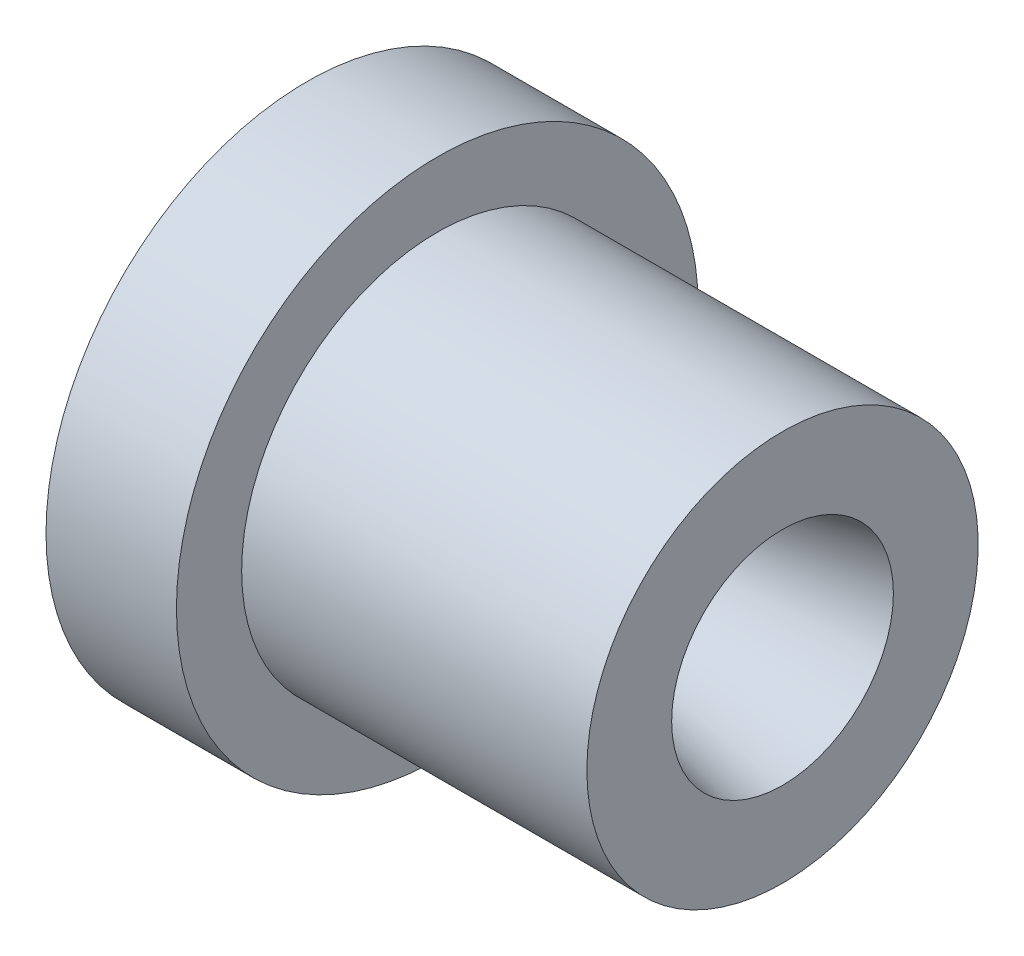
ISO-10303-21;
HEADER;
FILE_DESCRIPTION(('STEP AP214'),'2;1');
FILE_NAME('part.step','',(''),(''),'','','');
FILE_SCHEMA(('AUTOMOTIVE_DESIGN { 1 0 10303 214 1 1 1 1 }'));
ENDSEC;
DATA;
#1=APPLICATION_CONTEXT('core data for automotive mechanical design processes');
#2=APPLICATION_PROTOCOL_DEFINITION('international standard','automotive_design',2000,#1);
#3=PRODUCT_CONTEXT('',#1,'mechanical');
#4=PRODUCT('Part','Part','',(#3));
#5=PRODUCT_RELATED_PRODUCT_CATEGORY('part','',(#4));
#6=PRODUCT_DEFINITION_FORMATION('','',#4);
#7=PRODUCT_DEFINITION_CONTEXT('part definition',#1,'design');
#8=PRODUCT_DEFINITION('design','',#6,#7);
#9=PRODUCT_DEFINITION_SHAPE('','',#8);
#10=(LENGTH_UNIT() NAMED_UNIT(*) SI_UNIT(.MILLI.,.METRE.));
#11=(NAMED_UNIT(*) PLANE_ANGLE_UNIT() SI_UNIT($,.RADIAN.));
#12=(NAMED_UNIT(*) SI_UNIT($,.STERADIAN.) SOLID_ANGLE_UNIT());
#13=UNCERTAINTY_MEASURE_WITH_UNIT(LENGTH_MEASURE(1.E-05),#10,'distance_accuracy_value','');
#14=(GEOMETRIC_REPRESENTATION_CONTEXT(3) GLOBAL_UNCERTAINTY_ASSIGNED_CONTEXT((#13)) GLOBAL_UNIT_ASSIGNED_CONTEXT((#10,
#11,#12)) REPRESENTATION_CONTEXT('',''));
#15=CARTESIAN_POINT('',(0.,0.,0.));
#16=DIRECTION('',(0.,0.,1.));
#17=DIRECTION('',(1.,0.,0.));
#18=AXIS2_PLACEMENT_3D('',#15,#16,#17);
#19=CARTESIAN_POINT('',(-10.,20.,0.));
#20=DIRECTION('',(1.,0.,0.));
#21=DIRECTION('',(0.,0.,-1.));
#22=AXIS2_PLACEMENT_3D('',#19,#20,#21);
#23=PLANE('',#22);
#24=CARTESIAN_POINT('',(-10.,0.,0.));
#25=DIRECTION('',(-1.,0.,0.));
#26=DIRECTION('',(0.,0.,1.));
#27=AXIS2_PLACEMENT_3D('',#24,#25,#26);
#28=CIRCLE('',#27,15.);
#29=CARTESIAN_POINT('',(-10.,0.,15.));
#30=VERTEX_POINT('',#29);
#31=EDGE_CURVE('E10',#30,#30,#28,.T.);
#32=ORIENTED_EDGE('',*,*,#31,.F.);
#33=EDGE_LOOP('',(#32));
#34=FACE_BOUND('',#33,.T.);
#35=CARTESIAN_POINT('',(-10.,0.,0.));
#36=DIRECTION('',(-1.,0.,0.));
#37=DIRECTION('',(0.,0.,1.));
#38=AXIS2_PLACEMENT_3D('',#35,#36,#37);
#39=CIRCLE('',#38,20.);
#40=CARTESIAN_POINT('',(-10.,0.,20.));
#41=VERTEX_POINT('',#40);
#42=EDGE_CURVE('E61',#41,#41,#39,.T.);
#43=ORIENTED_EDGE('',*,*,#42,.T.);
#44=EDGE_LOOP('',(#43));
#45=FACE_BOUND('',#44,.T.);
#46=ADVANCED_FACE('F33',(#34,#45),#23,.F.);
#47=CARTESIAN_POINT('',(-10.,0.,0.));
#48=DIRECTION('',(-1.,0.,0.));
#49=DIRECTION('',(0.,0.,1.));
#50=AXIS2_PLACEMENT_3D('',#47,#48,#49);
#51=CONICAL_SURFACE('',#50,15.,0.78539816339745);
#52=CARTESIAN_POINT('',(0.,0.,0.));
#53=DIRECTION('',(-1.,0.,0.));
#54=DIRECTION('',(0.,0.,1.));
#55=AXIS2_PLACEMENT_3D('',#52,#53,#54);
#56=CIRCLE('',#55,5.);
#57=CARTESIAN_POINT('',(0.,0.,5.));
#58=VERTEX_POINT('',#57);
#59=EDGE_CURVE('E39',#58,#58,#56,.T.);
#60=ORIENTED_EDGE('',*,*,#59,.F.);
#61=EDGE_LOOP('',(#60));
#62=FACE_BOUND('',#61,.T.);
#63=ORIENTED_EDGE('',*,*,#31,.T.);
#64=EDGE_LOOP('',(#63));
#65=FACE_BOUND('',#64,.T.);
#66=ADVANCED_FACE('F98',(#62,#65),#51,.F.);
#67=CARTESIAN_POINT('',(-30.3012048192771,0.,0.));
#68=DIRECTION('',(-1.,0.,0.));
#69=DIRECTION('',(0.,0.,1.));
#70=AXIS2_PLACEMENT_3D('',#67,#68,#69);
#71=CYLINDRICAL_SURFACE('',#70,5.);
#72=CARTESIAN_POINT('',(9.99999999999997,0.,0.));
#73=DIRECTION('',(-1.,0.,0.));
#74=DIRECTION('',(0.,0.,1.));
#75=AXIS2_PLACEMENT_3D('',#72,#73,#74);
#76=CIRCLE('',#75,5.);
#77=CARTESIAN_POINT('',(9.99999999999997,0.,5.));
#78=VERTEX_POINT('',#77);
#79=EDGE_CURVE('E43',#78,#78,#76,.T.);
#80=ORIENTED_EDGE('',*,*,#79,.F.);
#81=EDGE_LOOP('',(#80));
#82=FACE_BOUND('',#81,.T.);
#83=ORIENTED_EDGE('',*,*,#59,.T.);
#84=EDGE_LOOP('',(#83));
#85=FACE_BOUND('',#84,.T.);
#86=ADVANCED_FACE('F93',(#82,#85),#71,.F.);
#87=CARTESIAN_POINT('',(9.99999999999997,0.,0.));
#88=DIRECTION('',(1.,0.,0.));
#89=DIRECTION('',(0.,0.,-1.));
#90=AXIS2_PLACEMENT_3D('',#87,#88,#89);
#91=CONICAL_SURFACE('',#90,5.,0.20943951023932);
#92=CARTESIAN_POINT('',(26.4662053831745,0.,0.));
#93=DIRECTION('',(-1.,0.,0.));
#94=DIRECTION('',(0.,0.,1.));
#95=AXIS2_PLACEMENT_3D('',#92,#93,#94);
#96=CIRCLE('',#95,8.5);
#97=CARTESIAN_POINT('',(26.4662053831745,0.,8.5));
#98=VERTEX_POINT('',#97);
#99=EDGE_CURVE('E47',#98,#98,#96,.T.);
#100=ORIENTED_EDGE('',*,*,#99,.F.);
#101=EDGE_LOOP('',(#100));
#102=FACE_BOUND('',#101,.T.);
#103=ORIENTED_EDGE('',*,*,#79,.T.);
#104=EDGE_LOOP('',(#103));
#105=FACE_BOUND('',#104,.T.);
#106=ADVANCED_FACE('F87',(#102,#105),#91,.F.);
#107=CARTESIAN_POINT('',(26.4662053831745,8.5,0.));
#108=DIRECTION('',(-1.,0.,0.));
#109=DIRECTION('',(0.,0.,1.));
#110=AXIS2_PLACEMENT_3D('',#107,#108,#109);
#111=PLANE('',#110);
#112=CARTESIAN_POINT('',(26.4662053831745,0.,0.));
#113=DIRECTION('',(-1.,0.,0.));
#114=DIRECTION('',(0.,0.,1.));
#115=AXIS2_PLACEMENT_3D('',#112,#113,#114);
#116=CIRCLE('',#115,15.);
#117=CARTESIAN_POINT('',(26.4662053831745,0.,15.));
#118=VERTEX_POINT('',#117);
#119=EDGE_CURVE('E52',#118,#118,#116,.T.);
#120=ORIENTED_EDGE('',*,*,#119,.F.);
#121=EDGE_LOOP('',(#120));
#122=FACE_BOUND('',#121,.T.);
#123=ORIENTED_EDGE('',*,*,#99,.T.);
#124=EDGE_LOOP('',(#123));
#125=FACE_BOUND('',#124,.T.);
#126=ADVANCED_FACE('F81',(#122,#125),#111,.F.);
#127=CARTESIAN_POINT('',(-30.3012048192771,0.,0.));
#128=DIRECTION('',(-1.,0.,0.));
#129=DIRECTION('',(0.,0.,1.));
#130=AXIS2_PLACEMENT_3D('',#127,#128,#129);
#131=CYLINDRICAL_SURFACE('',#130,15.);
#132=CARTESIAN_POINT('',(0.,0.,0.));
#133=DIRECTION('',(-1.,0.,0.));
#134=DIRECTION('',(0.,0.,1.));
#135=AXIS2_PLACEMENT_3D('',#132,#133,#134);
#136=CIRCLE('',#135,15.);
#137=CARTESIAN_POINT('',(0.,0.,15.));
#138=VERTEX_POINT('',#137);
#139=EDGE_CURVE('E55',#138,#138,#136,.T.);
#140=ORIENTED_EDGE('',*,*,#139,.F.);
#141=EDGE_LOOP('',(#140));
#142=FACE_BOUND('',#141,.T.);
#143=ORIENTED_EDGE('',*,*,#119,.T.);
#144=EDGE_LOOP('',(#143));
#145=FACE_BOUND('',#144,.T.);
#146=ADVANCED_FACE('F75',(#142,#145),#131,.T.);
#147=CARTESIAN_POINT('',(0.,20.,0.));
#148=DIRECTION('',(-1.,0.,0.));
#149=DIRECTION('',(0.,0.,1.));
#150=AXIS2_PLACEMENT_3D('',#147,#148,#149);
#151=PLANE('',#150);
#152=CARTESIAN_POINT('',(0.,0.,0.));
#153=DIRECTION('',(-1.,0.,0.));
#154=DIRECTION('',(0.,0.,1.));
#155=AXIS2_PLACEMENT_3D('',#152,#153,#154);
#156=CIRCLE('',#155,20.);
#157=CARTESIAN_POINT('',(0.,0.,20.));
#158=VERTEX_POINT('',#157);
#159=EDGE_CURVE('E58',#158,#158,#156,.T.);
#160=ORIENTED_EDGE('',*,*,#159,.F.);
#161=EDGE_LOOP('',(#160));
#162=FACE_BOUND('',#161,.T.);
#163=ORIENTED_EDGE('',*,*,#139,.T.);
#164=EDGE_LOOP('',(#163));
#165=FACE_BOUND('',#164,.T.);
#166=ADVANCED_FACE('F69',(#162,#165),#151,.F.);
#167=CARTESIAN_POINT('',(-30.3012048192771,0.,0.));
#168=DIRECTION('',(-1.,0.,0.));
#169=DIRECTION('',(0.,0.,1.));
#170=AXIS2_PLACEMENT_3D('',#167,#168,#169);
#171=CYLINDRICAL_SURFACE('',#170,20.);
#172=ORIENTED_EDGE('',*,*,#42,.F.);
#173=EDGE_LOOP('',(#172));
#174=FACE_BOUND('',#173,.T.);
#175=ORIENTED_EDGE('',*,*,#159,.T.);
#176=EDGE_LOOP('',(#175));
#177=FACE_BOUND('',#176,.T.);
#178=ADVANCED_FACE('F66',(#174,#177),#171,.T.);
#179=CLOSED_SHELL('',(#46,#66,#86,#106,#126,#146,#166,#178));
#180=MANIFOLD_SOLID_BREP('B2',#179);
#181=ADVANCED_BREP_SHAPE_REPRESENTATION('',(#18,#180),#14);
#182=SHAPE_DEFINITION_REPRESENTATION(#9,#181);
ENDSEC;
END-ISO-10303-21;
